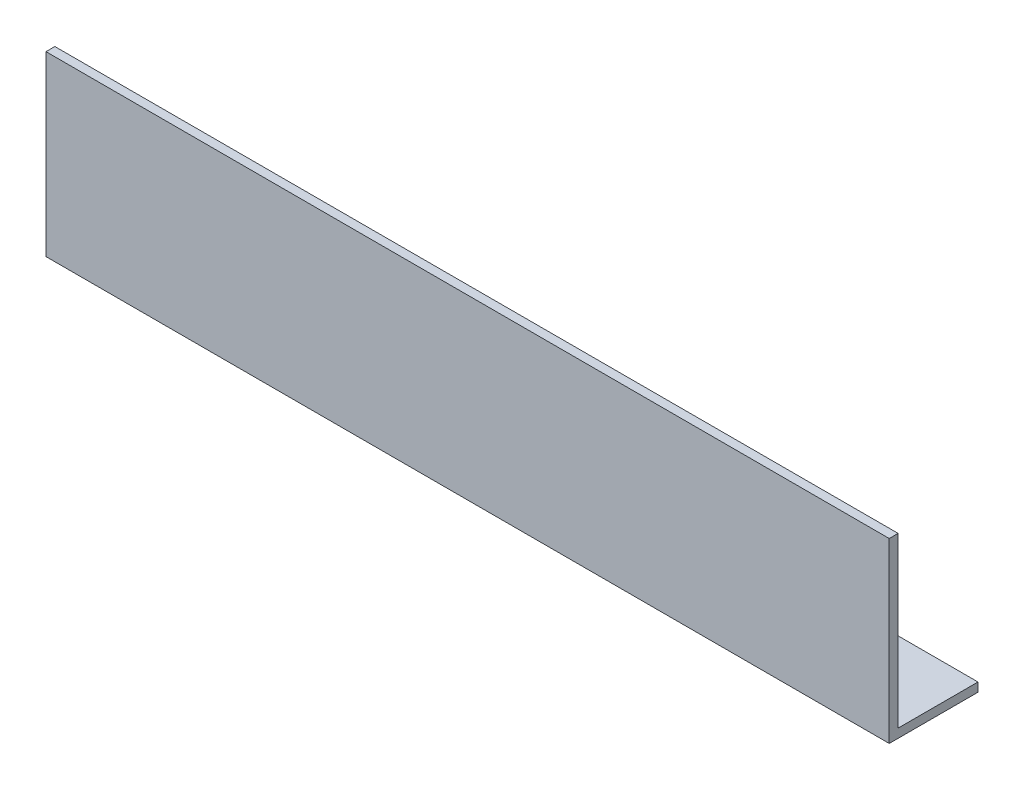
ISO-10303-21;
HEADER;
FILE_DESCRIPTION(('STEP AP214'),'2;1');
FILE_NAME('part.step','',(''),(''),'','','');
FILE_SCHEMA(('AUTOMOTIVE_DESIGN { 1 0 10303 214 1 1 1 1 }'));
ENDSEC;
DATA;
#1=APPLICATION_CONTEXT('core data for automotive mechanical design processes');
#2=APPLICATION_PROTOCOL_DEFINITION('international standard','automotive_design',2000,#1);
#3=PRODUCT_CONTEXT('',#1,'mechanical');
#4=PRODUCT('Part','Part','',(#3));
#5=PRODUCT_RELATED_PRODUCT_CATEGORY('part','',(#4));
#6=PRODUCT_DEFINITION_FORMATION('','',#4);
#7=PRODUCT_DEFINITION_CONTEXT('part definition',#1,'design');
#8=PRODUCT_DEFINITION('design','',#6,#7);
#9=PRODUCT_DEFINITION_SHAPE('','',#8);
#10=(LENGTH_UNIT() NAMED_UNIT(*) SI_UNIT(.MILLI.,.METRE.));
#11=(NAMED_UNIT(*) PLANE_ANGLE_UNIT() SI_UNIT($,.RADIAN.));
#12=(NAMED_UNIT(*) SI_UNIT($,.STERADIAN.) SOLID_ANGLE_UNIT());
#13=UNCERTAINTY_MEASURE_WITH_UNIT(LENGTH_MEASURE(1.E-05),#10,'distance_accuracy_value','');
#14=(GEOMETRIC_REPRESENTATION_CONTEXT(3) GLOBAL_UNCERTAINTY_ASSIGNED_CONTEXT((#13)) GLOBAL_UNIT_ASSIGNED_CONTEXT((#10,
#11,#12)) REPRESENTATION_CONTEXT('',''));
#15=CARTESIAN_POINT('',(0.,0.,0.));
#16=DIRECTION('',(0.,0.,1.));
#17=DIRECTION('',(1.,0.,0.));
#18=AXIS2_PLACEMENT_3D('',#15,#16,#17);
#19=CARTESIAN_POINT('',(190.,0.,0.));
#20=DIRECTION('',(0.,1.,0.));
#21=DIRECTION('',(0.,0.,1.));
#22=AXIS2_PLACEMENT_3D('',#19,#20,#21);
#23=PLANE('',#22);
#24=DIRECTION('',(0.,0.,-1.));
#25=VECTOR('',#24,1.);
#26=CARTESIAN_POINT('',(0.,0.,0.));
#27=LINE('',#26,#25);
#28=CARTESIAN_POINT('',(0.,0.,0.));
#29=VERTEX_POINT('',#28);
#30=CARTESIAN_POINT('',(0.,0.,-20.));
#31=VERTEX_POINT('',#30);
#32=EDGE_CURVE('E115',#29,#31,#27,.T.);
#33=ORIENTED_EDGE('',*,*,#32,.T.);
#34=DIRECTION('',(-1.,0.,0.));
#35=VECTOR('',#34,1.);
#36=CARTESIAN_POINT('',(190.,0.,-20.));
#37=LINE('',#36,#35);
#38=CARTESIAN_POINT('',(190.,0.,-20.));
#39=VERTEX_POINT('',#38);
#40=EDGE_CURVE('E11',#39,#31,#37,.T.);
#41=ORIENTED_EDGE('',*,*,#40,.F.);
#42=DIRECTION('',(0.,0.,-1.));
#43=VECTOR('',#42,1.);
#44=CARTESIAN_POINT('',(190.,0.,0.));
#45=LINE('',#44,#43);
#46=CARTESIAN_POINT('',(190.,0.,0.));
#47=VERTEX_POINT('',#46);
#48=EDGE_CURVE('E80',#47,#39,#45,.T.);
#49=ORIENTED_EDGE('',*,*,#48,.F.);
#50=DIRECTION('',(-1.,0.,0.));
#51=VECTOR('',#50,1.);
#52=CARTESIAN_POINT('',(190.,0.,0.));
#53=LINE('',#52,#51);
#54=EDGE_CURVE('E111',#47,#29,#53,.T.);
#55=ORIENTED_EDGE('',*,*,#54,.T.);
#56=EDGE_LOOP('',(#33,#41,#49,#55));
#57=FACE_BOUND('',#56,.T.);
#58=ADVANCED_FACE('F34',(#57),#23,.F.);
#59=CARTESIAN_POINT('',(190.,2.,-20.));
#60=DIRECTION('',(0.,0.,-1.));
#61=DIRECTION('',(-1.,0.,0.));
#62=AXIS2_PLACEMENT_3D('',#59,#60,#61);
#63=PLANE('',#62);
#64=DIRECTION('',(0.,-1.,0.));
#65=VECTOR('',#64,1.);
#66=CARTESIAN_POINT('',(0.,2.,-20.));
#67=LINE('',#66,#65);
#68=CARTESIAN_POINT('',(0.,2.,-20.));
#69=VERTEX_POINT('',#68);
#70=EDGE_CURVE('E118',#69,#31,#67,.T.);
#71=ORIENTED_EDGE('',*,*,#70,.F.);
#72=DIRECTION('',(-1.,0.,0.));
#73=VECTOR('',#72,1.);
#74=CARTESIAN_POINT('',(190.,2.,-20.));
#75=LINE('',#74,#73);
#76=CARTESIAN_POINT('',(190.,2.,-20.));
#77=VERTEX_POINT('',#76);
#78=EDGE_CURVE('E42',#77,#69,#75,.T.);
#79=ORIENTED_EDGE('',*,*,#78,.F.);
#80=DIRECTION('',(0.,-1.,0.));
#81=VECTOR('',#80,1.);
#82=CARTESIAN_POINT('',(190.,2.,-20.));
#83=LINE('',#82,#81);
#84=EDGE_CURVE('E204',#77,#39,#83,.T.);
#85=ORIENTED_EDGE('',*,*,#84,.T.);
#86=ORIENTED_EDGE('',*,*,#40,.T.);
#87=EDGE_LOOP('',(#71,#79,#85,#86));
#88=FACE_BOUND('',#87,.T.);
#89=ADVANCED_FACE('F136',(#88),#63,.T.);
#90=CARTESIAN_POINT('',(190.,2.,0.));
#91=DIRECTION('',(0.,1.,0.));
#92=DIRECTION('',(0.,0.,1.));
#93=AXIS2_PLACEMENT_3D('',#90,#91,#92);
#94=PLANE('',#93);
#95=DIRECTION('',(0.,0.,-1.));
#96=VECTOR('',#95,1.);
#97=CARTESIAN_POINT('',(0.,2.,0.));
#98=LINE('',#97,#96);
#99=CARTESIAN_POINT('',(0.,2.,-2.));
#100=VERTEX_POINT('',#99);
#101=EDGE_CURVE('E121',#100,#69,#98,.T.);
#102=ORIENTED_EDGE('',*,*,#101,.F.);
#103=DIRECTION('',(-1.,0.,0.));
#104=VECTOR('',#103,1.);
#105=CARTESIAN_POINT('',(190.,2.,-2.));
#106=LINE('',#105,#104);
#107=CARTESIAN_POINT('',(190.,2.,-2.));
#108=VERTEX_POINT('',#107);
#109=EDGE_CURVE('E101',#108,#100,#106,.T.);
#110=ORIENTED_EDGE('',*,*,#109,.F.);
#111=DIRECTION('',(0.,0.,-1.));
#112=VECTOR('',#111,1.);
#113=CARTESIAN_POINT('',(190.,2.,0.));
#114=LINE('',#113,#112);
#115=EDGE_CURVE('E107',#108,#77,#114,.T.);
#116=ORIENTED_EDGE('',*,*,#115,.T.);
#117=ORIENTED_EDGE('',*,*,#78,.T.);
#118=EDGE_LOOP('',(#102,#110,#116,#117));
#119=FACE_BOUND('',#118,.T.);
#120=ADVANCED_FACE('F133',(#119),#94,.T.);
#121=CARTESIAN_POINT('',(190.,40.,-2.));
#122=DIRECTION('',(0.,0.,-1.));
#123=DIRECTION('',(0.,1.,0.));
#124=AXIS2_PLACEMENT_3D('',#121,#122,#123);
#125=PLANE('',#124);
#126=DIRECTION('',(0.,-1.,0.));
#127=VECTOR('',#126,1.);
#128=CARTESIAN_POINT('',(0.,40.,-2.));
#129=LINE('',#128,#127);
#130=CARTESIAN_POINT('',(0.,40.,-2.));
#131=VERTEX_POINT('',#130);
#132=EDGE_CURVE('E96',#131,#100,#129,.T.);
#133=ORIENTED_EDGE('',*,*,#132,.F.);
#134=DIRECTION('',(-1.,0.,0.));
#135=VECTOR('',#134,1.);
#136=CARTESIAN_POINT('',(190.,40.,-2.));
#137=LINE('',#136,#135);
#138=CARTESIAN_POINT('',(190.,40.,-2.));
#139=VERTEX_POINT('',#138);
#140=EDGE_CURVE('E91',#139,#131,#137,.T.);
#141=ORIENTED_EDGE('',*,*,#140,.F.);
#142=DIRECTION('',(0.,-1.,0.));
#143=VECTOR('',#142,1.);
#144=CARTESIAN_POINT('',(190.,40.,-2.));
#145=LINE('',#144,#143);
#146=EDGE_CURVE('E94',#139,#108,#145,.T.);
#147=ORIENTED_EDGE('',*,*,#146,.T.);
#148=ORIENTED_EDGE('',*,*,#109,.T.);
#149=EDGE_LOOP('',(#133,#141,#147,#148));
#150=FACE_BOUND('',#149,.T.);
#151=ADVANCED_FACE('F93',(#150),#125,.T.);
#152=CARTESIAN_POINT('',(190.,40.,0.));
#153=DIRECTION('',(0.,1.,0.));
#154=DIRECTION('',(0.,0.,1.));
#155=AXIS2_PLACEMENT_3D('',#152,#153,#154);
#156=PLANE('',#155);
#157=DIRECTION('',(0.,0.,-1.));
#158=VECTOR('',#157,1.);
#159=CARTESIAN_POINT('',(0.,40.,0.));
#160=LINE('',#159,#158);
#161=CARTESIAN_POINT('',(0.,40.,0.));
#162=VERTEX_POINT('',#161);
#163=EDGE_CURVE('E125',#162,#131,#160,.T.);
#164=ORIENTED_EDGE('',*,*,#163,.F.);
#165=DIRECTION('',(-1.,0.,0.));
#166=VECTOR('',#165,1.);
#167=CARTESIAN_POINT('',(190.,40.,0.));
#168=LINE('',#167,#166);
#169=CARTESIAN_POINT('',(190.,40.,0.));
#170=VERTEX_POINT('',#169);
#171=EDGE_CURVE('E71',#170,#162,#168,.T.);
#172=ORIENTED_EDGE('',*,*,#171,.F.);
#173=DIRECTION('',(0.,0.,-1.));
#174=VECTOR('',#173,1.);
#175=CARTESIAN_POINT('',(190.,40.,0.));
#176=LINE('',#175,#174);
#177=EDGE_CURVE('E105',#170,#139,#176,.T.);
#178=ORIENTED_EDGE('',*,*,#177,.T.);
#179=ORIENTED_EDGE('',*,*,#140,.T.);
#180=EDGE_LOOP('',(#164,#172,#178,#179));
#181=FACE_BOUND('',#180,.T.);
#182=ADVANCED_FACE('F109',(#181),#156,.T.);
#183=CARTESIAN_POINT('',(190.,40.,0.));
#184=DIRECTION('',(0.,0.,-1.));
#185=DIRECTION('',(0.,1.,0.));
#186=AXIS2_PLACEMENT_3D('',#183,#184,#185);
#187=PLANE('',#186);
#188=DIRECTION('',(0.,-1.,0.));
#189=VECTOR('',#188,1.);
#190=CARTESIAN_POINT('',(0.,40.,0.));
#191=LINE('',#190,#189);
#192=EDGE_CURVE('E74',#162,#29,#191,.T.);
#193=ORIENTED_EDGE('',*,*,#192,.T.);
#194=ORIENTED_EDGE('',*,*,#54,.F.);
#195=DIRECTION('',(0.,-1.,0.));
#196=VECTOR('',#195,1.);
#197=CARTESIAN_POINT('',(190.,40.,0.));
#198=LINE('',#197,#196);
#199=EDGE_CURVE('E50',#170,#47,#198,.T.);
#200=ORIENTED_EDGE('',*,*,#199,.F.);
#201=ORIENTED_EDGE('',*,*,#171,.T.);
#202=EDGE_LOOP('',(#193,#194,#200,#201));
#203=FACE_BOUND('',#202,.T.);
#204=ADVANCED_FACE('F141',(#203),#187,.F.);
#205=CARTESIAN_POINT('',(190.,0.,0.));
#206=DIRECTION('',(-1.,0.,0.));
#207=DIRECTION('',(0.,0.,1.));
#208=AXIS2_PLACEMENT_3D('',#205,#206,#207);
#209=PLANE('',#208);
#210=ORIENTED_EDGE('',*,*,#48,.T.);
#211=ORIENTED_EDGE('',*,*,#84,.F.);
#212=ORIENTED_EDGE('',*,*,#115,.F.);
#213=ORIENTED_EDGE('',*,*,#146,.F.);
#214=ORIENTED_EDGE('',*,*,#177,.F.);
#215=ORIENTED_EDGE('',*,*,#199,.T.);
#216=EDGE_LOOP('',(#210,#211,#212,#213,#214,#215));
#217=FACE_BOUND('',#216,.T.);
#218=ADVANCED_FACE('F104',(#217),#209,.F.);
#219=CARTESIAN_POINT('',(0.,0.,0.));
#220=DIRECTION('',(-1.,0.,0.));
#221=DIRECTION('',(0.,0.,1.));
#222=AXIS2_PLACEMENT_3D('',#219,#220,#221);
#223=PLANE('',#222);
#224=ORIENTED_EDGE('',*,*,#32,.F.);
#225=ORIENTED_EDGE('',*,*,#192,.F.);
#226=ORIENTED_EDGE('',*,*,#163,.T.);
#227=ORIENTED_EDGE('',*,*,#132,.T.);
#228=ORIENTED_EDGE('',*,*,#101,.T.);
#229=ORIENTED_EDGE('',*,*,#70,.T.);
#230=EDGE_LOOP('',(#224,#225,#226,#227,#228,#229));
#231=FACE_BOUND('',#230,.T.);
#232=ADVANCED_FACE('F139',(#231),#223,.T.);
#233=CLOSED_SHELL('',(#58,#89,#120,#151,#182,#204,#218,#232));
#234=MANIFOLD_SOLID_BREP('B2',#233);
#235=ADVANCED_BREP_SHAPE_REPRESENTATION('',(#18,#234),#14);
#236=SHAPE_DEFINITION_REPRESENTATION(#9,#235);
ENDSEC;
END-ISO-10303-21;
